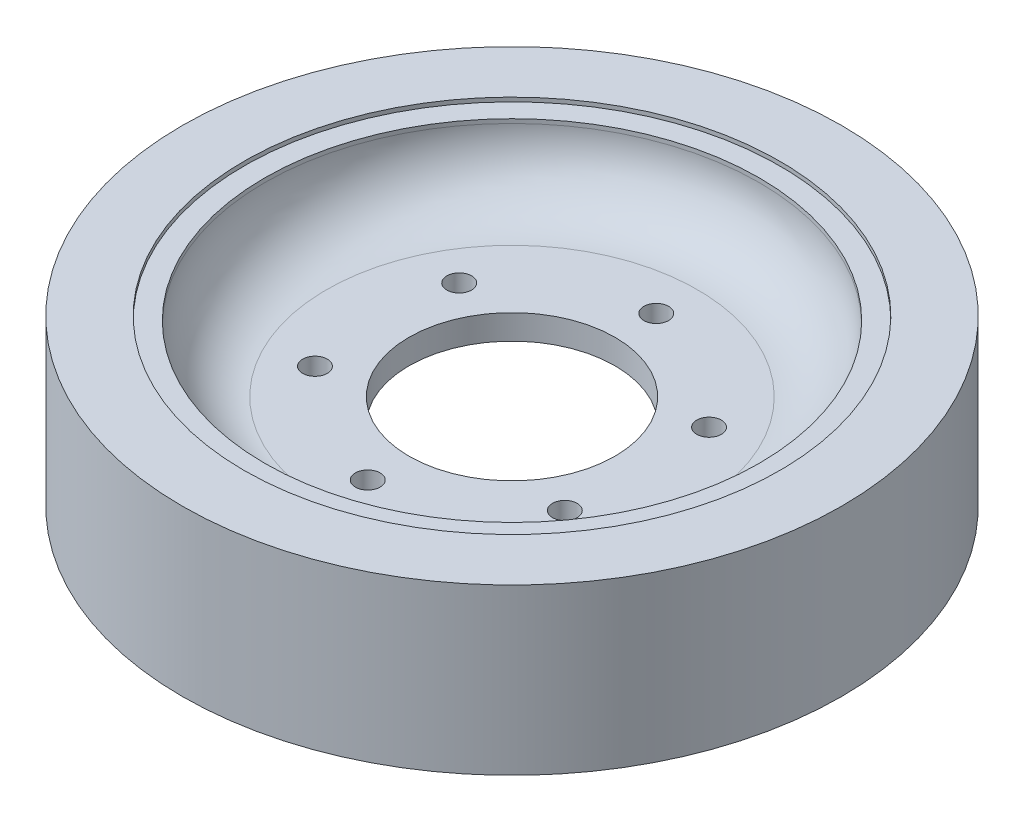
ISO-10303-21;
HEADER;
FILE_DESCRIPTION(('STEP AP214'),'2;1');
FILE_NAME('part.step','',(''),(''),'','','');
FILE_SCHEMA(('AUTOMOTIVE_DESIGN { 1 0 10303 214 1 1 1 1 }'));
ENDSEC;
DATA;
#1=APPLICATION_CONTEXT('core data for automotive mechanical design processes');
#2=APPLICATION_PROTOCOL_DEFINITION('international standard','automotive_design',2000,#1);
#3=PRODUCT_CONTEXT('',#1,'mechanical');
#4=PRODUCT('Part','Part','',(#3));
#5=PRODUCT_RELATED_PRODUCT_CATEGORY('part','',(#4));
#6=PRODUCT_DEFINITION_FORMATION('','',#4);
#7=PRODUCT_DEFINITION_CONTEXT('part definition',#1,'design');
#8=PRODUCT_DEFINITION('design','',#6,#7);
#9=PRODUCT_DEFINITION_SHAPE('','',#8);
#10=(LENGTH_UNIT() NAMED_UNIT(*) SI_UNIT(.MILLI.,.METRE.));
#11=(NAMED_UNIT(*) PLANE_ANGLE_UNIT() SI_UNIT($,.RADIAN.));
#12=(NAMED_UNIT(*) SI_UNIT($,.STERADIAN.) SOLID_ANGLE_UNIT());
#13=UNCERTAINTY_MEASURE_WITH_UNIT(LENGTH_MEASURE(1.E-05),#10,'distance_accuracy_value','');
#14=(GEOMETRIC_REPRESENTATION_CONTEXT(3) GLOBAL_UNCERTAINTY_ASSIGNED_CONTEXT((#13)) GLOBAL_UNIT_ASSIGNED_CONTEXT((#10,
#11,#12)) REPRESENTATION_CONTEXT('',''));
#15=CARTESIAN_POINT('',(0.,0.,0.));
#16=DIRECTION('',(0.,0.,1.));
#17=DIRECTION('',(1.,0.,0.));
#18=AXIS2_PLACEMENT_3D('',#15,#16,#17);
#19=CARTESIAN_POINT('',(0.,23.,0.));
#20=DIRECTION('',(0.,1.,0.));
#21=DIRECTION('',(0.,0.,1.));
#22=AXIS2_PLACEMENT_3D('',#19,#20,#21);
#23=CYLINDRICAL_SURFACE('',#22,60.);
#24=CARTESIAN_POINT('',(0.,38.,0.));
#25=DIRECTION('',(0.,1.,0.));
#26=DIRECTION('',(0.,0.,1.));
#27=AXIS2_PLACEMENT_3D('',#24,#25,#26);
#28=CIRCLE('',#27,60.);
#29=CARTESIAN_POINT('',(0.,38.,60.));
#30=VERTEX_POINT('',#29);
#31=EDGE_CURVE('E44',#30,#30,#28,.F.);
#32=ORIENTED_EDGE('',*,*,#31,.T.);
#33=EDGE_LOOP('',(#32));
#34=FACE_BOUND('',#33,.T.);
#35=CARTESIAN_POINT('',(0.,39.,0.));
#36=DIRECTION('',(0.,1.,0.));
#37=DIRECTION('',(0.,0.,1.));
#38=AXIS2_PLACEMENT_3D('',#35,#36,#37);
#39=CIRCLE('',#38,60.);
#40=CARTESIAN_POINT('',(0.,39.,60.));
#41=VERTEX_POINT('',#40);
#42=EDGE_CURVE('E54',#41,#41,#39,.F.);
#43=ORIENTED_EDGE('',*,*,#42,.F.);
#44=EDGE_LOOP('',(#43));
#45=FACE_BOUND('',#44,.T.);
#46=ADVANCED_FACE('F33',(#34,#45),#23,.F.);
#47=CARTESIAN_POINT('',(0.,17.,0.));
#48=DIRECTION('',(0.,-1.,0.));
#49=DIRECTION('',(0.,0.,-1.));
#50=AXIS2_PLACEMENT_3D('',#47,#48,#49);
#51=CYLINDRICAL_SURFACE('',#50,60.);
#52=CARTESIAN_POINT('',(0.,2.,0.));
#53=DIRECTION('',(0.,-1.,0.));
#54=DIRECTION('',(0.,0.,-1.));
#55=AXIS2_PLACEMENT_3D('',#52,#53,#54);
#56=CIRCLE('',#55,60.);
#57=CARTESIAN_POINT('',(0.,2.,-60.));
#58=VERTEX_POINT('',#57);
#59=EDGE_CURVE('E10',#58,#58,#56,.F.);
#60=ORIENTED_EDGE('',*,*,#59,.T.);
#61=EDGE_LOOP('',(#60));
#62=FACE_BOUND('',#61,.T.);
#63=CARTESIAN_POINT('',(0.,1.,0.));
#64=DIRECTION('',(0.,-1.,0.));
#65=DIRECTION('',(0.,0.,-1.));
#66=AXIS2_PLACEMENT_3D('',#63,#64,#65);
#67=CIRCLE('',#66,60.);
#68=CARTESIAN_POINT('',(0.,1.,-60.));
#69=VERTEX_POINT('',#68);
#70=EDGE_CURVE('E59',#69,#69,#67,.F.);
#71=ORIENTED_EDGE('',*,*,#70,.F.);
#72=EDGE_LOOP('',(#71));
#73=FACE_BOUND('',#72,.T.);
#74=ADVANCED_FACE('F156',(#62,#73),#51,.F.);
#75=CARTESIAN_POINT('',(0.,0.,0.));
#76=DIRECTION('',(0.,1.,0.));
#77=DIRECTION('',(0.,0.,1.));
#78=AXIS2_PLACEMENT_3D('',#75,#76,#77);
#79=CYLINDRICAL_SURFACE('',#78,25.);
#80=CARTESIAN_POINT('',(0.,23.,0.));
#81=DIRECTION('',(0.,1.,0.));
#82=DIRECTION('',(0.,0.,1.));
#83=AXIS2_PLACEMENT_3D('',#80,#81,#82);
#84=CIRCLE('',#83,25.);
#85=CARTESIAN_POINT('',(0.,23.,25.));
#86=VERTEX_POINT('',#85);
#87=EDGE_CURVE('E70',#86,#86,#84,.T.);
#88=ORIENTED_EDGE('',*,*,#87,.T.);
#89=EDGE_LOOP('',(#88));
#90=FACE_BOUND('',#89,.T.);
#91=CARTESIAN_POINT('',(0.,17.,0.));
#92=DIRECTION('',(0.,-1.,0.));
#93=DIRECTION('',(0.,0.,-1.));
#94=AXIS2_PLACEMENT_3D('',#91,#92,#93);
#95=CIRCLE('',#94,25.);
#96=CARTESIAN_POINT('',(0.,17.,-25.));
#97=VERTEX_POINT('',#96);
#98=EDGE_CURVE('E91',#97,#97,#95,.F.);
#99=ORIENTED_EDGE('',*,*,#98,.F.);
#100=EDGE_LOOP('',(#99));
#101=FACE_BOUND('',#100,.T.);
#102=ADVANCED_FACE('F162',(#90,#101),#79,.F.);
#103=CARTESIAN_POINT('',(30.3108891324568,0.,-17.5000000000026));
#104=DIRECTION('',(0.,1.,0.));
#105=DIRECTION('',(0.,0.,1.));
#106=AXIS2_PLACEMENT_3D('',#103,#104,#105);
#107=CYLINDRICAL_SURFACE('',#106,3.00000000000075);
#108=CARTESIAN_POINT('',(30.3108891324568,23.,-17.5000000000026));
#109=DIRECTION('',(0.,1.,0.));
#110=DIRECTION('',(0.,0.,1.));
#111=AXIS2_PLACEMENT_3D('',#108,#109,#110);
#112=CIRCLE('',#111,3.00000000000075);
#113=CARTESIAN_POINT('',(30.3108891324568,23.,-14.5000000000018));
#114=VERTEX_POINT('',#113);
#115=EDGE_CURVE('E86',#114,#114,#112,.T.);
#116=ORIENTED_EDGE('',*,*,#115,.T.);
#117=EDGE_LOOP('',(#116));
#118=FACE_BOUND('',#117,.T.);
#119=CARTESIAN_POINT('',(30.3108891324568,17.,-17.5000000000026));
#120=DIRECTION('',(0.,-1.,0.));
#121=DIRECTION('',(0.,0.,-1.));
#122=AXIS2_PLACEMENT_3D('',#119,#120,#121);
#123=CIRCLE('',#122,3.00000000000075);
#124=CARTESIAN_POINT('',(30.3108891324568,17.,-20.5000000000033));
#125=VERTEX_POINT('',#124);
#126=EDGE_CURVE('E96',#125,#125,#123,.F.);
#127=ORIENTED_EDGE('',*,*,#126,.F.);
#128=EDGE_LOOP('',(#127));
#129=FACE_BOUND('',#128,.T.);
#130=ADVANCED_FACE('F168',(#118,#129),#107,.F.);
#131=CARTESIAN_POINT('',(30.3108891324598,0.,17.4999999999974));
#132=DIRECTION('',(0.,1.,0.));
#133=DIRECTION('',(0.,0.,1.));
#134=AXIS2_PLACEMENT_3D('',#131,#132,#133);
#135=CYLINDRICAL_SURFACE('',#134,3.00000000000369);
#136=CARTESIAN_POINT('',(30.3108891324598,23.,17.4999999999974));
#137=DIRECTION('',(0.,1.,0.));
#138=DIRECTION('',(0.,0.,1.));
#139=AXIS2_PLACEMENT_3D('',#136,#137,#138);
#140=CIRCLE('',#139,3.00000000000369);
#141=CARTESIAN_POINT('',(30.3108891324598,23.,20.5000000000011));
#142=VERTEX_POINT('',#141);
#143=EDGE_CURVE('E83',#142,#142,#140,.T.);
#144=ORIENTED_EDGE('',*,*,#143,.T.);
#145=EDGE_LOOP('',(#144));
#146=FACE_BOUND('',#145,.T.);
#147=CARTESIAN_POINT('',(30.3108891324598,17.,17.4999999999974));
#148=DIRECTION('',(0.,-1.,0.));
#149=DIRECTION('',(0.,0.,-1.));
#150=AXIS2_PLACEMENT_3D('',#147,#148,#149);
#151=CIRCLE('',#150,3.00000000000369);
#152=CARTESIAN_POINT('',(30.3108891324598,17.,14.4999999999937));
#153=VERTEX_POINT('',#152);
#154=EDGE_CURVE('E99',#153,#153,#151,.F.);
#155=ORIENTED_EDGE('',*,*,#154,.F.);
#156=EDGE_LOOP('',(#155));
#157=FACE_BOUND('',#156,.T.);
#158=ADVANCED_FACE('F178',(#146,#157),#135,.F.);
#159=CARTESIAN_POINT('',(5.95998645279081E-12,0.,35.));
#160=DIRECTION('',(0.,1.,0.));
#161=DIRECTION('',(0.,0.,1.));
#162=AXIS2_PLACEMENT_3D('',#159,#160,#161);
#163=CYLINDRICAL_SURFACE('',#162,3.00000000000594);
#164=CARTESIAN_POINT('',(5.95998645279081E-12,23.,35.));
#165=DIRECTION('',(0.,1.,0.));
#166=DIRECTION('',(0.,0.,1.));
#167=AXIS2_PLACEMENT_3D('',#164,#165,#166);
#168=CIRCLE('',#167,3.00000000000594);
#169=CARTESIAN_POINT('',(5.95998645279081E-12,23.,38.0000000000059));
#170=VERTEX_POINT('',#169);
#171=EDGE_CURVE('E79',#170,#170,#168,.T.);
#172=ORIENTED_EDGE('',*,*,#171,.T.);
#173=EDGE_LOOP('',(#172));
#174=FACE_BOUND('',#173,.T.);
#175=CARTESIAN_POINT('',(5.95998645279081E-12,17.,35.));
#176=DIRECTION('',(0.,-1.,0.));
#177=DIRECTION('',(0.,0.,-1.));
#178=AXIS2_PLACEMENT_3D('',#175,#176,#177);
#179=CIRCLE('',#178,3.00000000000594);
#180=CARTESIAN_POINT('',(5.95998645279081E-12,17.,31.9999999999941));
#181=VERTEX_POINT('',#180);
#182=EDGE_CURVE('E102',#181,#181,#179,.F.);
#183=ORIENTED_EDGE('',*,*,#182,.F.);
#184=EDGE_LOOP('',(#183));
#185=FACE_BOUND('',#184,.T.);
#186=ADVANCED_FACE('F174',(#174,#185),#163,.F.);
#187=CARTESIAN_POINT('',(-30.3108891324509,0.,17.5000000000026));
#188=DIRECTION('',(0.,1.,0.));
#189=DIRECTION('',(0.,0.,1.));
#190=AXIS2_PLACEMENT_3D('',#187,#188,#189);
#191=CYLINDRICAL_SURFACE('',#190,3.00000000000535);
#192=CARTESIAN_POINT('',(-30.3108891324509,23.,17.5000000000026));
#193=DIRECTION('',(0.,1.,0.));
#194=DIRECTION('',(0.,0.,1.));
#195=AXIS2_PLACEMENT_3D('',#192,#193,#194);
#196=CIRCLE('',#195,3.00000000000535);
#197=CARTESIAN_POINT('',(-30.3108891324509,23.,20.5000000000079));
#198=VERTEX_POINT('',#197);
#199=EDGE_CURVE('E76',#198,#198,#196,.T.);
#200=ORIENTED_EDGE('',*,*,#199,.T.);
#201=EDGE_LOOP('',(#200));
#202=FACE_BOUND('',#201,.T.);
#203=CARTESIAN_POINT('',(-30.3108891324509,17.,17.5000000000026));
#204=DIRECTION('',(0.,-1.,0.));
#205=DIRECTION('',(0.,0.,-1.));
#206=AXIS2_PLACEMENT_3D('',#203,#204,#205);
#207=CIRCLE('',#206,3.00000000000535);
#208=CARTESIAN_POINT('',(-30.3108891324509,17.,14.4999999999972));
#209=VERTEX_POINT('',#208);
#210=EDGE_CURVE('E105',#209,#209,#207,.F.);
#211=ORIENTED_EDGE('',*,*,#210,.F.);
#212=EDGE_LOOP('',(#211));
#213=FACE_BOUND('',#212,.T.);
#214=ADVANCED_FACE('F170',(#202,#213),#191,.F.);
#215=CARTESIAN_POINT('',(-30.3108891324539,0.,-17.4999999999974));
#216=DIRECTION('',(0.,1.,0.));
#217=DIRECTION('',(0.,0.,1.));
#218=AXIS2_PLACEMENT_3D('',#215,#216,#217);
#219=CYLINDRICAL_SURFACE('',#218,3.00000000000259);
#220=CARTESIAN_POINT('',(-30.3108891324539,23.,-17.4999999999974));
#221=DIRECTION('',(0.,1.,0.));
#222=DIRECTION('',(0.,0.,1.));
#223=AXIS2_PLACEMENT_3D('',#220,#221,#222);
#224=CIRCLE('',#223,3.00000000000259);
#225=CARTESIAN_POINT('',(-30.3108891324539,23.,-14.4999999999948));
#226=VERTEX_POINT('',#225);
#227=EDGE_CURVE('E80',#226,#226,#224,.T.);
#228=ORIENTED_EDGE('',*,*,#227,.T.);
#229=EDGE_LOOP('',(#228));
#230=FACE_BOUND('',#229,.T.);
#231=CARTESIAN_POINT('',(-30.3108891324539,17.,-17.4999999999974));
#232=DIRECTION('',(0.,-1.,0.));
#233=DIRECTION('',(0.,0.,-1.));
#234=AXIS2_PLACEMENT_3D('',#231,#232,#233);
#235=CIRCLE('',#234,3.00000000000259);
#236=CARTESIAN_POINT('',(-30.3108891324539,17.,-20.5));
#237=VERTEX_POINT('',#236);
#238=EDGE_CURVE('E66',#237,#237,#235,.F.);
#239=ORIENTED_EDGE('',*,*,#238,.F.);
#240=EDGE_LOOP('',(#239));
#241=FACE_BOUND('',#240,.T.);
#242=ADVANCED_FACE('F173',(#230,#241),#219,.F.);
#243=CARTESIAN_POINT('',(0.,0.,-35.));
#244=DIRECTION('',(0.,1.,0.));
#245=DIRECTION('',(0.,0.,1.));
#246=AXIS2_PLACEMENT_3D('',#243,#244,#245);
#247=CYLINDRICAL_SURFACE('',#246,3.);
#248=CARTESIAN_POINT('',(0.,23.,-35.));
#249=DIRECTION('',(0.,1.,0.));
#250=DIRECTION('',(0.,0.,1.));
#251=AXIS2_PLACEMENT_3D('',#248,#249,#250);
#252=CIRCLE('',#251,3.);
#253=CARTESIAN_POINT('',(0.,23.,-32.));
#254=VERTEX_POINT('',#253);
#255=EDGE_CURVE('E75',#254,#254,#252,.T.);
#256=ORIENTED_EDGE('',*,*,#255,.T.);
#257=EDGE_LOOP('',(#256));
#258=FACE_BOUND('',#257,.T.);
#259=CARTESIAN_POINT('',(0.,17.,-35.));
#260=DIRECTION('',(0.,-1.,0.));
#261=DIRECTION('',(0.,0.,-1.));
#262=AXIS2_PLACEMENT_3D('',#259,#260,#261);
#263=CIRCLE('',#262,3.);
#264=CARTESIAN_POINT('',(0.,17.,-38.));
#265=VERTEX_POINT('',#264);
#266=EDGE_CURVE('E62',#265,#265,#263,.F.);
#267=ORIENTED_EDGE('',*,*,#266,.F.);
#268=EDGE_LOOP('',(#267));
#269=FACE_BOUND('',#268,.T.);
#270=ADVANCED_FACE('F140',(#258,#269),#247,.F.);
#271=CARTESIAN_POINT('',(0.,40.,0.));
#272=DIRECTION('',(0.,-1.,0.));
#273=DIRECTION('',(0.,0.,-1.));
#274=AXIS2_PLACEMENT_3D('',#271,#272,#273);
#275=CYLINDRICAL_SURFACE('',#274,80.);
#276=CARTESIAN_POINT('',(0.,40.,0.));
#277=DIRECTION('',(0.,1.,0.));
#278=DIRECTION('',(0.,0.,1.));
#279=AXIS2_PLACEMENT_3D('',#276,#277,#278);
#280=CIRCLE('',#279,80.);
#281=CARTESIAN_POINT('',(0.,40.,80.));
#282=VERTEX_POINT('',#281);
#283=EDGE_CURVE('E53',#282,#282,#280,.T.);
#284=ORIENTED_EDGE('',*,*,#283,.F.);
#285=EDGE_LOOP('',(#284));
#286=FACE_BOUND('',#285,.T.);
#287=CARTESIAN_POINT('',(0.,0.,0.));
#288=DIRECTION('',(0.,1.,0.));
#289=DIRECTION('',(0.,0.,1.));
#290=AXIS2_PLACEMENT_3D('',#287,#288,#289);
#291=CIRCLE('',#290,80.);
#292=CARTESIAN_POINT('',(0.,0.,80.));
#293=VERTEX_POINT('',#292);
#294=EDGE_CURVE('E67',#293,#293,#291,.T.);
#295=ORIENTED_EDGE('',*,*,#294,.T.);
#296=EDGE_LOOP('',(#295));
#297=FACE_BOUND('',#296,.T.);
#298=ADVANCED_FACE('F134',(#286,#297),#275,.T.);
#299=CARTESIAN_POINT('',(0.,40.,0.));
#300=DIRECTION('',(0.,1.,0.));
#301=DIRECTION('',(0.,0.,1.));
#302=AXIS2_PLACEMENT_3D('',#299,#300,#301);
#303=PLANE('',#302);
#304=CARTESIAN_POINT('',(0.,40.,0.));
#305=DIRECTION('',(0.,1.,0.));
#306=DIRECTION('',(0.,0.,1.));
#307=AXIS2_PLACEMENT_3D('',#304,#305,#306);
#308=CIRCLE('',#307,65.);
#309=CARTESIAN_POINT('',(0.,40.,65.));
#310=VERTEX_POINT('',#309);
#311=EDGE_CURVE('E114',#310,#310,#308,.T.);
#312=ORIENTED_EDGE('',*,*,#311,.F.);
#313=EDGE_LOOP('',(#312));
#314=FACE_BOUND('',#313,.T.);
#315=ORIENTED_EDGE('',*,*,#283,.T.);
#316=EDGE_LOOP('',(#315));
#317=FACE_BOUND('',#316,.T.);
#318=ADVANCED_FACE('F130',(#314,#317),#303,.T.);
#319=CARTESIAN_POINT('',(0.,0.,0.));
#320=DIRECTION('',(0.,1.,0.));
#321=DIRECTION('',(0.,0.,1.));
#322=AXIS2_PLACEMENT_3D('',#319,#320,#321);
#323=PLANE('',#322);
#324=CARTESIAN_POINT('',(0.,0.,0.));
#325=DIRECTION('',(0.,-1.,0.));
#326=DIRECTION('',(0.,0.,-1.));
#327=AXIS2_PLACEMENT_3D('',#324,#325,#326);
#328=CIRCLE('',#327,65.);
#329=CARTESIAN_POINT('',(0.,0.,-65.));
#330=VERTEX_POINT('',#329);
#331=EDGE_CURVE('E57',#330,#330,#328,.T.);
#332=ORIENTED_EDGE('',*,*,#331,.F.);
#333=EDGE_LOOP('',(#332));
#334=FACE_BOUND('',#333,.T.);
#335=ORIENTED_EDGE('',*,*,#294,.F.);
#336=EDGE_LOOP('',(#335));
#337=FACE_BOUND('',#336,.T.);
#338=ADVANCED_FACE('F133',(#334,#337),#323,.F.);
#339=CARTESIAN_POINT('',(0.,23.,0.));
#340=DIRECTION('',(0.,1.,0.));
#341=DIRECTION('',(0.,0.,1.));
#342=AXIS2_PLACEMENT_3D('',#339,#340,#341);
#343=PLANE('',#342);
#344=CARTESIAN_POINT('',(0.,23.,0.));
#345=DIRECTION('',(0.,1.,0.));
#346=DIRECTION('',(0.,0.,1.));
#347=AXIS2_PLACEMENT_3D('',#344,#345,#346);
#348=CIRCLE('',#347,45.);
#349=CARTESIAN_POINT('',(0.,23.,45.));
#350=VERTEX_POINT('',#349);
#351=EDGE_CURVE('E48',#350,#350,#348,.T.);
#352=ORIENTED_EDGE('',*,*,#351,.T.);
#353=EDGE_LOOP('',(#352));
#354=FACE_BOUND('',#353,.T.);
#355=ORIENTED_EDGE('',*,*,#255,.F.);
#356=EDGE_LOOP('',(#355));
#357=FACE_BOUND('',#356,.T.);
#358=ORIENTED_EDGE('',*,*,#227,.F.);
#359=EDGE_LOOP('',(#358));
#360=FACE_BOUND('',#359,.T.);
#361=ORIENTED_EDGE('',*,*,#199,.F.);
#362=EDGE_LOOP('',(#361));
#363=FACE_BOUND('',#362,.T.);
#364=ORIENTED_EDGE('',*,*,#171,.F.);
#365=EDGE_LOOP('',(#364));
#366=FACE_BOUND('',#365,.T.);
#367=ORIENTED_EDGE('',*,*,#143,.F.);
#368=EDGE_LOOP('',(#367));
#369=FACE_BOUND('',#368,.T.);
#370=ORIENTED_EDGE('',*,*,#115,.F.);
#371=EDGE_LOOP('',(#370));
#372=FACE_BOUND('',#371,.T.);
#373=ORIENTED_EDGE('',*,*,#87,.F.);
#374=EDGE_LOOP('',(#373));
#375=FACE_BOUND('',#374,.T.);
#376=ADVANCED_FACE('F145',(#354,#357,#360,#363,#366,#369,#372,#375),#343,.T.);
#377=CARTESIAN_POINT('',(0.,17.,0.));
#378=DIRECTION('',(0.,-1.,0.));
#379=DIRECTION('',(0.,0.,-1.));
#380=AXIS2_PLACEMENT_3D('',#377,#378,#379);
#381=PLANE('',#380);
#382=CARTESIAN_POINT('',(0.,17.,0.));
#383=DIRECTION('',(0.,-1.,0.));
#384=DIRECTION('',(0.,0.,-1.));
#385=AXIS2_PLACEMENT_3D('',#382,#383,#384);
#386=CIRCLE('',#385,45.);
#387=CARTESIAN_POINT('',(0.,17.,-45.));
#388=VERTEX_POINT('',#387);
#389=EDGE_CURVE('E40',#388,#388,#386,.T.);
#390=ORIENTED_EDGE('',*,*,#389,.T.);
#391=EDGE_LOOP('',(#390));
#392=FACE_BOUND('',#391,.T.);
#393=ORIENTED_EDGE('',*,*,#266,.T.);
#394=EDGE_LOOP('',(#393));
#395=FACE_BOUND('',#394,.T.);
#396=ORIENTED_EDGE('',*,*,#238,.T.);
#397=EDGE_LOOP('',(#396));
#398=FACE_BOUND('',#397,.T.);
#399=ORIENTED_EDGE('',*,*,#210,.T.);
#400=EDGE_LOOP('',(#399));
#401=FACE_BOUND('',#400,.T.);
#402=ORIENTED_EDGE('',*,*,#182,.T.);
#403=EDGE_LOOP('',(#402));
#404=FACE_BOUND('',#403,.T.);
#405=ORIENTED_EDGE('',*,*,#154,.T.);
#406=EDGE_LOOP('',(#405));
#407=FACE_BOUND('',#406,.T.);
#408=ORIENTED_EDGE('',*,*,#126,.T.);
#409=EDGE_LOOP('',(#408));
#410=FACE_BOUND('',#409,.T.);
#411=ORIENTED_EDGE('',*,*,#98,.T.);
#412=EDGE_LOOP('',(#411));
#413=FACE_BOUND('',#412,.T.);
#414=ADVANCED_FACE('F151',(#392,#395,#398,#401,#404,#407,#410,#413),#381,.T.);
#415=CARTESIAN_POINT('',(0.,1.,0.));
#416=DIRECTION('',(0.,-1.,0.));
#417=DIRECTION('',(0.,0.,-1.));
#418=AXIS2_PLACEMENT_3D('',#415,#416,#417);
#419=PLANE('',#418);
#420=CARTESIAN_POINT('',(0.,1.,0.));
#421=DIRECTION('',(0.,-1.,0.));
#422=DIRECTION('',(0.,0.,-1.));
#423=AXIS2_PLACEMENT_3D('',#420,#421,#422);
#424=CIRCLE('',#423,65.);
#425=CARTESIAN_POINT('',(0.,1.,-65.));
#426=VERTEX_POINT('',#425);
#427=EDGE_CURVE('E63',#426,#426,#424,.T.);
#428=ORIENTED_EDGE('',*,*,#427,.T.);
#429=EDGE_LOOP('',(#428));
#430=FACE_BOUND('',#429,.T.);
#431=ORIENTED_EDGE('',*,*,#70,.T.);
#432=EDGE_LOOP('',(#431));
#433=FACE_BOUND('',#432,.T.);
#434=ADVANCED_FACE('F194',(#430,#433),#419,.T.);
#435=CARTESIAN_POINT('',(0.,1.,0.));
#436=DIRECTION('',(0.,-1.,0.));
#437=DIRECTION('',(0.,0.,-1.));
#438=AXIS2_PLACEMENT_3D('',#435,#436,#437);
#439=CYLINDRICAL_SURFACE('',#438,65.);
#440=ORIENTED_EDGE('',*,*,#427,.F.);
#441=EDGE_LOOP('',(#440));
#442=FACE_BOUND('',#441,.T.);
#443=ORIENTED_EDGE('',*,*,#331,.T.);
#444=EDGE_LOOP('',(#443));
#445=FACE_BOUND('',#444,.T.);
#446=ADVANCED_FACE('F195',(#442,#445),#439,.F.);
#447=CARTESIAN_POINT('',(0.,39.,0.));
#448=DIRECTION('',(0.,1.,0.));
#449=DIRECTION('',(0.,0.,1.));
#450=AXIS2_PLACEMENT_3D('',#447,#448,#449);
#451=PLANE('',#450);
#452=CARTESIAN_POINT('',(0.,39.,0.));
#453=DIRECTION('',(0.,1.,0.));
#454=DIRECTION('',(0.,0.,1.));
#455=AXIS2_PLACEMENT_3D('',#452,#453,#454);
#456=CIRCLE('',#455,65.);
#457=CARTESIAN_POINT('',(0.,39.,65.));
#458=VERTEX_POINT('',#457);
#459=EDGE_CURVE('E58',#458,#458,#456,.T.);
#460=ORIENTED_EDGE('',*,*,#459,.T.);
#461=EDGE_LOOP('',(#460));
#462=FACE_BOUND('',#461,.T.);
#463=ORIENTED_EDGE('',*,*,#42,.T.);
#464=EDGE_LOOP('',(#463));
#465=FACE_BOUND('',#464,.T.);
#466=ADVANCED_FACE('F120',(#462,#465),#451,.T.);
#467=CARTESIAN_POINT('',(0.,39.,0.));
#468=DIRECTION('',(0.,1.,0.));
#469=DIRECTION('',(0.,0.,1.));
#470=AXIS2_PLACEMENT_3D('',#467,#468,#469);
#471=CYLINDRICAL_SURFACE('',#470,65.);
#472=ORIENTED_EDGE('',*,*,#459,.F.);
#473=EDGE_LOOP('',(#472));
#474=FACE_BOUND('',#473,.T.);
#475=ORIENTED_EDGE('',*,*,#311,.T.);
#476=EDGE_LOOP('',(#475));
#477=FACE_BOUND('',#476,.T.);
#478=ADVANCED_FACE('F123',(#474,#477),#471,.F.);
#479=CARTESIAN_POINT('',(0.,38.,0.));
#480=DIRECTION('',(0.,1.,0.));
#481=DIRECTION('',(0.,0.,1.));
#482=AXIS2_PLACEMENT_3D('',#479,#480,#481);
#483=TOROIDAL_SURFACE('',#482,45.,15.);
#484=ORIENTED_EDGE('',*,*,#31,.F.);
#485=EDGE_LOOP('',(#484));
#486=FACE_BOUND('',#485,.T.);
#487=ORIENTED_EDGE('',*,*,#351,.F.);
#488=EDGE_LOOP('',(#487));
#489=FACE_BOUND('',#488,.T.);
#490=ADVANCED_FACE('F126',(#486,#489),#483,.F.);
#491=CARTESIAN_POINT('',(0.,2.,0.));
#492=DIRECTION('',(0.,-1.,0.));
#493=DIRECTION('',(0.,0.,-1.));
#494=AXIS2_PLACEMENT_3D('',#491,#492,#493);
#495=TOROIDAL_SURFACE('',#494,45.,15.);
#496=ORIENTED_EDGE('',*,*,#59,.F.);
#497=EDGE_LOOP('',(#496));
#498=FACE_BOUND('',#497,.T.);
#499=ORIENTED_EDGE('',*,*,#389,.F.);
#500=EDGE_LOOP('',(#499));
#501=FACE_BOUND('',#500,.T.);
#502=ADVANCED_FACE('F35',(#498,#501),#495,.F.);
#503=CLOSED_SHELL('',(#46,#74,#102,#130,#158,#186,#214,#242,#270,#298,#318,#338,#376,#414,#434,
#446,#466,#478,#490,#502));
#504=MANIFOLD_SOLID_BREP('B2',#503);
#505=ADVANCED_BREP_SHAPE_REPRESENTATION('',(#18,#504),#14);
#506=SHAPE_DEFINITION_REPRESENTATION(#9,#505);
ENDSEC;
END-ISO-10303-21;
